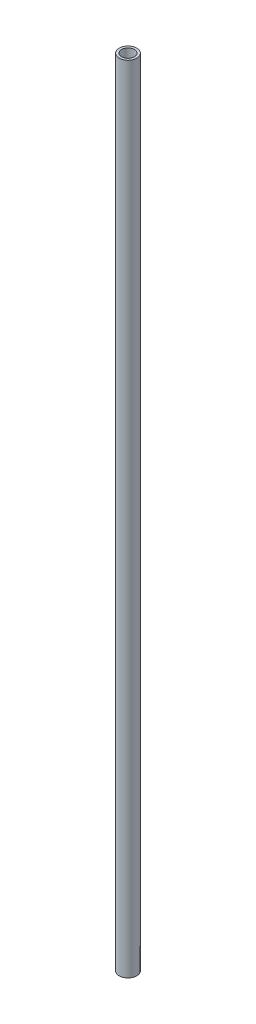
ISO-10303-21;
HEADER;
FILE_DESCRIPTION(('STEP AP214'),'2;1');
FILE_NAME('part.step','',(''),(''),'','','');
FILE_SCHEMA(('AUTOMOTIVE_DESIGN { 1 0 10303 214 1 1 1 1 }'));
ENDSEC;
DATA;
#1=APPLICATION_CONTEXT('core data for automotive mechanical design processes');
#2=APPLICATION_PROTOCOL_DEFINITION('international standard','automotive_design',2000,#1);
#3=PRODUCT_CONTEXT('',#1,'mechanical');
#4=PRODUCT('Part','Part','',(#3));
#5=PRODUCT_RELATED_PRODUCT_CATEGORY('part','',(#4));
#6=PRODUCT_DEFINITION_FORMATION('','',#4);
#7=PRODUCT_DEFINITION_CONTEXT('part definition',#1,'design');
#8=PRODUCT_DEFINITION('design','',#6,#7);
#9=PRODUCT_DEFINITION_SHAPE('','',#8);
#10=(LENGTH_UNIT() NAMED_UNIT(*) SI_UNIT(.MILLI.,.METRE.));
#11=(NAMED_UNIT(*) PLANE_ANGLE_UNIT() SI_UNIT($,.RADIAN.));
#12=(NAMED_UNIT(*) SI_UNIT($,.STERADIAN.) SOLID_ANGLE_UNIT());
#13=UNCERTAINTY_MEASURE_WITH_UNIT(LENGTH_MEASURE(1.E-05),#10,'distance_accuracy_value','');
#14=(GEOMETRIC_REPRESENTATION_CONTEXT(3) GLOBAL_UNCERTAINTY_ASSIGNED_CONTEXT((#13)) GLOBAL_UNIT_ASSIGNED_CONTEXT((#10,
#11,#12)) REPRESENTATION_CONTEXT('',''));
#15=CARTESIAN_POINT('',(0.,0.,0.));
#16=DIRECTION('',(0.,0.,1.));
#17=DIRECTION('',(1.,0.,0.));
#18=AXIS2_PLACEMENT_3D('',#15,#16,#17);
#19=CARTESIAN_POINT('',(0.,452.,0.));
#20=DIRECTION('',(0.,1.,0.));
#21=DIRECTION('',(0.,0.,1.));
#22=AXIS2_PLACEMENT_3D('',#19,#20,#21);
#23=PLANE('',#22);
#24=CARTESIAN_POINT('',(0.,452.,0.));
#25=DIRECTION('',(0.,1.,0.));
#26=DIRECTION('',(0.,0.,1.));
#27=AXIS2_PLACEMENT_3D('',#24,#25,#26);
#28=CIRCLE('',#27,4.975);
#29=CARTESIAN_POINT('',(0.,452.,4.975));
#30=VERTEX_POINT('',#29);
#31=EDGE_CURVE('E10',#30,#30,#28,.T.);
#32=ORIENTED_EDGE('',*,*,#31,.T.);
#33=EDGE_LOOP('',(#32));
#34=FACE_BOUND('',#33,.T.);
#35=CARTESIAN_POINT('',(0.,452.,0.));
#36=DIRECTION('',(0.,1.,0.));
#37=DIRECTION('',(0.,0.,1.));
#38=AXIS2_PLACEMENT_3D('',#35,#36,#37);
#39=CIRCLE('',#38,3.625);
#40=CARTESIAN_POINT('',(0.,452.,3.625));
#41=VERTEX_POINT('',#40);
#42=EDGE_CURVE('E43',#41,#41,#39,.T.);
#43=ORIENTED_EDGE('',*,*,#42,.F.);
#44=EDGE_LOOP('',(#43));
#45=FACE_BOUND('',#44,.T.);
#46=ADVANCED_FACE('F32',(#34,#45),#23,.T.);
#47=CARTESIAN_POINT('',(0.,0.,0.));
#48=DIRECTION('',(0.,1.,0.));
#49=DIRECTION('',(0.,0.,1.));
#50=AXIS2_PLACEMENT_3D('',#47,#48,#49);
#51=PLANE('',#50);
#52=CARTESIAN_POINT('',(0.,0.,0.));
#53=DIRECTION('',(0.,1.,0.));
#54=DIRECTION('',(0.,0.,1.));
#55=AXIS2_PLACEMENT_3D('',#52,#53,#54);
#56=CIRCLE('',#55,4.975);
#57=CARTESIAN_POINT('',(0.,0.,4.975));
#58=VERTEX_POINT('',#57);
#59=EDGE_CURVE('E36',#58,#58,#56,.T.);
#60=ORIENTED_EDGE('',*,*,#59,.F.);
#61=EDGE_LOOP('',(#60));
#62=FACE_BOUND('',#61,.T.);
#63=CARTESIAN_POINT('',(0.,0.,0.));
#64=DIRECTION('',(0.,1.,0.));
#65=DIRECTION('',(0.,0.,1.));
#66=AXIS2_PLACEMENT_3D('',#63,#64,#65);
#67=CIRCLE('',#66,3.625);
#68=CARTESIAN_POINT('',(0.,0.,3.625));
#69=VERTEX_POINT('',#68);
#70=EDGE_CURVE('E45',#69,#69,#67,.T.);
#71=ORIENTED_EDGE('',*,*,#70,.T.);
#72=EDGE_LOOP('',(#71));
#73=FACE_BOUND('',#72,.T.);
#74=ADVANCED_FACE('F55',(#62,#73),#51,.F.);
#75=CARTESIAN_POINT('',(0.,452.,0.));
#76=DIRECTION('',(0.,-1.,0.));
#77=DIRECTION('',(0.,0.,-1.));
#78=AXIS2_PLACEMENT_3D('',#75,#76,#77);
#79=CYLINDRICAL_SURFACE('',#78,4.975);
#80=ORIENTED_EDGE('',*,*,#31,.F.);
#81=EDGE_LOOP('',(#80));
#82=FACE_BOUND('',#81,.T.);
#83=ORIENTED_EDGE('',*,*,#59,.T.);
#84=EDGE_LOOP('',(#83));
#85=FACE_BOUND('',#84,.T.);
#86=ADVANCED_FACE('F34',(#82,#85),#79,.T.);
#87=CARTESIAN_POINT('',(0.,452.,0.));
#88=DIRECTION('',(0.,-1.,0.));
#89=DIRECTION('',(0.,0.,-1.));
#90=AXIS2_PLACEMENT_3D('',#87,#88,#89);
#91=CYLINDRICAL_SURFACE('',#90,3.625);
#92=ORIENTED_EDGE('',*,*,#42,.T.);
#93=EDGE_LOOP('',(#92));
#94=FACE_BOUND('',#93,.T.);
#95=ORIENTED_EDGE('',*,*,#70,.F.);
#96=EDGE_LOOP('',(#95));
#97=FACE_BOUND('',#96,.T.);
#98=ADVANCED_FACE('F51',(#94,#97),#91,.F.);
#99=CLOSED_SHELL('',(#46,#74,#86,#98));
#100=MANIFOLD_SOLID_BREP('B2',#99);
#101=ADVANCED_BREP_SHAPE_REPRESENTATION('',(#18,#100),#14);
#102=SHAPE_DEFINITION_REPRESENTATION(#9,#101);
ENDSEC;
END-ISO-10303-21;
